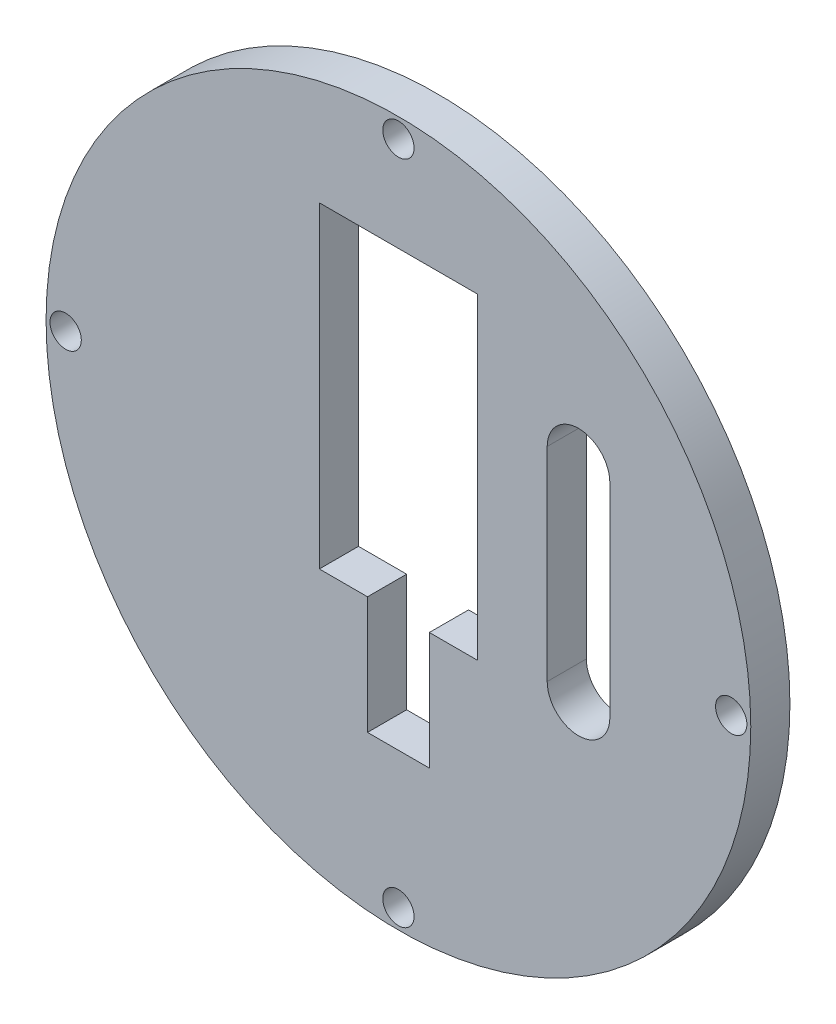
ISO-10303-21;
HEADER;
FILE_DESCRIPTION(('STEP AP214'),'2;1');
FILE_NAME('part.step','',(''),(''),'','','');
FILE_SCHEMA(('AUTOMOTIVE_DESIGN { 1 0 10303 214 1 1 1 1 }'));
ENDSEC;
DATA;
#1=APPLICATION_CONTEXT('core data for automotive mechanical design processes');
#2=APPLICATION_PROTOCOL_DEFINITION('international standard','automotive_design',2000,#1);
#3=PRODUCT_CONTEXT('',#1,'mechanical');
#4=PRODUCT('Part','Part','',(#3));
#5=PRODUCT_RELATED_PRODUCT_CATEGORY('part','',(#4));
#6=PRODUCT_DEFINITION_FORMATION('','',#4);
#7=PRODUCT_DEFINITION_CONTEXT('part definition',#1,'design');
#8=PRODUCT_DEFINITION('design','',#6,#7);
#9=PRODUCT_DEFINITION_SHAPE('','',#8);
#10=(LENGTH_UNIT() NAMED_UNIT(*) SI_UNIT(.MILLI.,.METRE.));
#11=(NAMED_UNIT(*) PLANE_ANGLE_UNIT() SI_UNIT($,.RADIAN.));
#12=(NAMED_UNIT(*) SI_UNIT($,.STERADIAN.) SOLID_ANGLE_UNIT());
#13=UNCERTAINTY_MEASURE_WITH_UNIT(LENGTH_MEASURE(1.E-05),#10,'distance_accuracy_value','');
#14=(GEOMETRIC_REPRESENTATION_CONTEXT(3) GLOBAL_UNCERTAINTY_ASSIGNED_CONTEXT((#13)) GLOBAL_UNIT_ASSIGNED_CONTEXT((#10,
#11,#12)) REPRESENTATION_CONTEXT('',''));
#15=CARTESIAN_POINT('',(0.,0.,0.));
#16=DIRECTION('',(0.,0.,1.));
#17=DIRECTION('',(1.,0.,0.));
#18=AXIS2_PLACEMENT_3D('',#15,#16,#17);
#19=CARTESIAN_POINT('',(0.,-10.1,5.));
#20=DIRECTION('',(0.,1.,0.));
#21=DIRECTION('',(0.,0.,1.));
#22=AXIS2_PLACEMENT_3D('',#19,#20,#21);
#23=PLANE('',#22);
#24=DIRECTION('',(0.,0.,-1.));
#25=VECTOR('',#24,1.);
#26=CARTESIAN_POINT('',(3.95,-10.1,10.));
#27=LINE('',#26,#25);
#28=CARTESIAN_POINT('',(3.95,-10.1,5.));
#29=VERTEX_POINT('',#28);
#30=CARTESIAN_POINT('',(3.95,-10.1,0.));
#31=VERTEX_POINT('',#30);
#32=EDGE_CURVE('E178',#29,#31,#27,.T.);
#33=ORIENTED_EDGE('',*,*,#32,.F.);
#34=DIRECTION('',(1.,0.,0.));
#35=VECTOR('',#34,1.);
#36=CARTESIAN_POINT('',(0.,-10.1,5.));
#37=LINE('',#36,#35);
#38=CARTESIAN_POINT('',(10.1,-10.1,5.));
#39=VERTEX_POINT('',#38);
#40=EDGE_CURVE('E213',#29,#39,#37,.T.);
#41=ORIENTED_EDGE('',*,*,#40,.T.);
#42=DIRECTION('',(0.,0.,-1.));
#43=VECTOR('',#42,1.);
#44=CARTESIAN_POINT('',(10.1,-10.1,5.));
#45=LINE('',#44,#43);
#46=CARTESIAN_POINT('',(10.1,-10.1,0.));
#47=VERTEX_POINT('',#46);
#48=EDGE_CURVE('E54',#39,#47,#45,.T.);
#49=ORIENTED_EDGE('',*,*,#48,.T.);
#50=DIRECTION('',(1.,0.,0.));
#51=VECTOR('',#50,1.);
#52=CARTESIAN_POINT('',(0.,-10.1,0.));
#53=LINE('',#52,#51);
#54=EDGE_CURVE('E241',#31,#47,#53,.T.);
#55=ORIENTED_EDGE('',*,*,#54,.F.);
#56=EDGE_LOOP('',(#33,#41,#49,#55));
#57=FACE_BOUND('',#56,.T.);
#58=ADVANCED_FACE('F46',(#57),#23,.T.);
#59=CARTESIAN_POINT('',(0.,30.4,5.));
#60=DIRECTION('',(0.,1.,0.));
#61=DIRECTION('',(0.,0.,1.));
#62=AXIS2_PLACEMENT_3D('',#59,#60,#61);
#63=PLANE('',#62);
#64=DIRECTION('',(1.,0.,0.));
#65=VECTOR('',#64,1.);
#66=CARTESIAN_POINT('',(0.,30.4,0.));
#67=LINE('',#66,#65);
#68=CARTESIAN_POINT('',(-10.1,30.4,0.));
#69=VERTEX_POINT('',#68);
#70=CARTESIAN_POINT('',(10.1,30.4,0.));
#71=VERTEX_POINT('',#70);
#72=EDGE_CURVE('E235',#69,#71,#67,.T.);
#73=ORIENTED_EDGE('',*,*,#72,.T.);
#74=DIRECTION('',(0.,0.,-1.));
#75=VECTOR('',#74,1.);
#76=CARTESIAN_POINT('',(10.1,30.4,5.));
#77=LINE('',#76,#75);
#78=CARTESIAN_POINT('',(10.1,30.4,5.));
#79=VERTEX_POINT('',#78);
#80=EDGE_CURVE('E13',#79,#71,#77,.T.);
#81=ORIENTED_EDGE('',*,*,#80,.F.);
#82=DIRECTION('',(1.,0.,0.));
#83=VECTOR('',#82,1.);
#84=CARTESIAN_POINT('',(0.,30.4,5.));
#85=LINE('',#84,#83);
#86=CARTESIAN_POINT('',(-10.1,30.4,5.));
#87=VERTEX_POINT('',#86);
#88=EDGE_CURVE('E207',#87,#79,#85,.T.);
#89=ORIENTED_EDGE('',*,*,#88,.F.);
#90=DIRECTION('',(0.,0.,-1.));
#91=VECTOR('',#90,1.);
#92=CARTESIAN_POINT('',(-10.1,30.4,5.));
#93=LINE('',#92,#91);
#94=EDGE_CURVE('E223',#87,#69,#93,.T.);
#95=ORIENTED_EDGE('',*,*,#94,.T.);
#96=EDGE_LOOP('',(#73,#81,#89,#95));
#97=FACE_BOUND('',#96,.T.);
#98=ADVANCED_FACE('F284',(#97),#63,.F.);
#99=CARTESIAN_POINT('',(10.1,0.,5.));
#100=DIRECTION('',(1.,0.,0.));
#101=DIRECTION('',(0.,1.,0.));
#102=AXIS2_PLACEMENT_3D('',#99,#100,#101);
#103=PLANE('',#102);
#104=DIRECTION('',(0.,-1.,0.));
#105=VECTOR('',#104,1.);
#106=CARTESIAN_POINT('',(10.1,0.,0.));
#107=LINE('',#106,#105);
#108=EDGE_CURVE('E238',#71,#47,#107,.T.);
#109=ORIENTED_EDGE('',*,*,#108,.T.);
#110=ORIENTED_EDGE('',*,*,#48,.F.);
#111=DIRECTION('',(0.,-1.,0.));
#112=VECTOR('',#111,1.);
#113=CARTESIAN_POINT('',(10.1,0.,5.));
#114=LINE('',#113,#112);
#115=EDGE_CURVE('E210',#79,#39,#114,.T.);
#116=ORIENTED_EDGE('',*,*,#115,.F.);
#117=ORIENTED_EDGE('',*,*,#80,.T.);
#118=EDGE_LOOP('',(#109,#110,#116,#117));
#119=FACE_BOUND('',#118,.T.);
#120=ADVANCED_FACE('F259',(#119),#103,.F.);
#121=DIRECTION('',(0.,0.,-1.));
#122=VECTOR('',#121,1.);
#123=CARTESIAN_POINT('',(-3.95,-10.1,10.));
#124=LINE('',#123,#122);
#125=CARTESIAN_POINT('',(-3.95,-10.1,5.));
#126=VERTEX_POINT('',#125);
#127=CARTESIAN_POINT('',(-3.95,-10.1,0.));
#128=VERTEX_POINT('',#127);
#129=EDGE_CURVE('E181',#126,#128,#124,.T.);
#130=ORIENTED_EDGE('',*,*,#129,.T.);
#131=CARTESIAN_POINT('',(-10.1,-10.1,0.));
#132=VERTEX_POINT('',#131);
#133=EDGE_CURVE('E242',#132,#128,#53,.T.);
#134=ORIENTED_EDGE('',*,*,#133,.F.);
#135=DIRECTION('',(0.,0.,-1.));
#136=VECTOR('',#135,1.);
#137=CARTESIAN_POINT('',(-10.1,-10.1,5.));
#138=LINE('',#137,#136);
#139=CARTESIAN_POINT('',(-10.1,-10.1,5.));
#140=VERTEX_POINT('',#139);
#141=EDGE_CURVE('E251',#140,#132,#138,.T.);
#142=ORIENTED_EDGE('',*,*,#141,.F.);
#143=EDGE_CURVE('E214',#140,#126,#37,.T.);
#144=ORIENTED_EDGE('',*,*,#143,.T.);
#145=EDGE_LOOP('',(#130,#134,#142,#144));
#146=FACE_BOUND('',#145,.T.);
#147=ADVANCED_FACE('F289',(#146),#23,.T.);
#148=CARTESIAN_POINT('',(-10.1,0.,5.));
#149=DIRECTION('',(1.,0.,0.));
#150=DIRECTION('',(0.,1.,0.));
#151=AXIS2_PLACEMENT_3D('',#148,#149,#150);
#152=PLANE('',#151);
#153=DIRECTION('',(0.,-1.,0.));
#154=VECTOR('',#153,1.);
#155=CARTESIAN_POINT('',(-10.1,0.,0.));
#156=LINE('',#155,#154);
#157=EDGE_CURVE('E245',#69,#132,#156,.T.);
#158=ORIENTED_EDGE('',*,*,#157,.F.);
#159=ORIENTED_EDGE('',*,*,#94,.F.);
#160=DIRECTION('',(0.,-1.,0.));
#161=VECTOR('',#160,1.);
#162=CARTESIAN_POINT('',(-10.1,0.,5.));
#163=LINE('',#162,#161);
#164=EDGE_CURVE('E217',#87,#140,#163,.T.);
#165=ORIENTED_EDGE('',*,*,#164,.T.);
#166=ORIENTED_EDGE('',*,*,#141,.T.);
#167=EDGE_LOOP('',(#158,#159,#165,#166));
#168=FACE_BOUND('',#167,.T.);
#169=ADVANCED_FACE('F286',(#168),#152,.T.);
#170=CARTESIAN_POINT('',(42.5,0.,5.));
#171=DIRECTION('',(0.,0.,-1.));
#172=DIRECTION('',(-1.,0.,0.));
#173=AXIS2_PLACEMENT_3D('',#170,#171,#172);
#174=CYLINDRICAL_SURFACE('',#173,2.);
#175=CARTESIAN_POINT('',(42.5,0.,5.));
#176=DIRECTION('',(0.,0.,1.));
#177=DIRECTION('',(1.,0.,0.));
#178=AXIS2_PLACEMENT_3D('',#175,#176,#177);
#179=CIRCLE('',#178,2.);
#180=CARTESIAN_POINT('',(44.5,0.,5.));
#181=VERTEX_POINT('',#180);
#182=EDGE_CURVE('E204',#181,#181,#179,.T.);
#183=ORIENTED_EDGE('',*,*,#182,.T.);
#184=EDGE_LOOP('',(#183));
#185=FACE_BOUND('',#184,.T.);
#186=CARTESIAN_POINT('',(42.5,0.,0.));
#187=DIRECTION('',(0.,0.,1.));
#188=DIRECTION('',(1.,0.,0.));
#189=AXIS2_PLACEMENT_3D('',#186,#187,#188);
#190=CIRCLE('',#189,2.);
#191=CARTESIAN_POINT('',(44.5,0.,0.));
#192=VERTEX_POINT('',#191);
#193=EDGE_CURVE('E232',#192,#192,#190,.T.);
#194=ORIENTED_EDGE('',*,*,#193,.F.);
#195=EDGE_LOOP('',(#194));
#196=FACE_BOUND('',#195,.T.);
#197=ADVANCED_FACE('F315',(#185,#196),#174,.F.);
#198=CARTESIAN_POINT('',(0.,-42.5,5.));
#199=DIRECTION('',(0.,0.,-1.));
#200=DIRECTION('',(-1.,0.,0.));
#201=AXIS2_PLACEMENT_3D('',#198,#199,#200);
#202=CYLINDRICAL_SURFACE('',#201,2.);
#203=CARTESIAN_POINT('',(0.,-42.5,5.));
#204=DIRECTION('',(0.,0.,1.));
#205=DIRECTION('',(1.,0.,0.));
#206=AXIS2_PLACEMENT_3D('',#203,#204,#205);
#207=CIRCLE('',#206,2.);
#208=CARTESIAN_POINT('',(2.00000000000001,-42.5,5.));
#209=VERTEX_POINT('',#208);
#210=EDGE_CURVE('E201',#209,#209,#207,.T.);
#211=ORIENTED_EDGE('',*,*,#210,.T.);
#212=EDGE_LOOP('',(#211));
#213=FACE_BOUND('',#212,.T.);
#214=CARTESIAN_POINT('',(0.,-42.5,0.));
#215=DIRECTION('',(0.,0.,1.));
#216=DIRECTION('',(1.,0.,0.));
#217=AXIS2_PLACEMENT_3D('',#214,#215,#216);
#218=CIRCLE('',#217,2.);
#219=CARTESIAN_POINT('',(2.00000000000001,-42.5,0.));
#220=VERTEX_POINT('',#219);
#221=EDGE_CURVE('E229',#220,#220,#218,.T.);
#222=ORIENTED_EDGE('',*,*,#221,.F.);
#223=EDGE_LOOP('',(#222));
#224=FACE_BOUND('',#223,.T.);
#225=ADVANCED_FACE('F321',(#213,#224),#202,.F.);
#226=CARTESIAN_POINT('',(-42.5,0.,5.));
#227=DIRECTION('',(0.,0.,-1.));
#228=DIRECTION('',(-1.,0.,0.));
#229=AXIS2_PLACEMENT_3D('',#226,#227,#228);
#230=CYLINDRICAL_SURFACE('',#229,2.);
#231=CARTESIAN_POINT('',(-42.5,0.,5.));
#232=DIRECTION('',(0.,0.,1.));
#233=DIRECTION('',(1.,0.,0.));
#234=AXIS2_PLACEMENT_3D('',#231,#232,#233);
#235=CIRCLE('',#234,2.);
#236=CARTESIAN_POINT('',(-40.5,0.,5.));
#237=VERTEX_POINT('',#236);
#238=EDGE_CURVE('E197',#237,#237,#235,.T.);
#239=ORIENTED_EDGE('',*,*,#238,.T.);
#240=EDGE_LOOP('',(#239));
#241=FACE_BOUND('',#240,.T.);
#242=CARTESIAN_POINT('',(-42.5,0.,0.));
#243=DIRECTION('',(0.,0.,1.));
#244=DIRECTION('',(1.,0.,0.));
#245=AXIS2_PLACEMENT_3D('',#242,#243,#244);
#246=CIRCLE('',#245,2.);
#247=CARTESIAN_POINT('',(-40.5,0.,0.));
#248=VERTEX_POINT('',#247);
#249=EDGE_CURVE('E226',#248,#248,#246,.T.);
#250=ORIENTED_EDGE('',*,*,#249,.F.);
#251=EDGE_LOOP('',(#250));
#252=FACE_BOUND('',#251,.T.);
#253=ADVANCED_FACE('F324',(#241,#252),#230,.F.);
#254=CARTESIAN_POINT('',(0.,42.5,5.));
#255=DIRECTION('',(0.,0.,-1.));
#256=DIRECTION('',(-1.,0.,0.));
#257=AXIS2_PLACEMENT_3D('',#254,#255,#256);
#258=CYLINDRICAL_SURFACE('',#257,2.);
#259=CARTESIAN_POINT('',(0.,42.5,5.));
#260=DIRECTION('',(0.,0.,1.));
#261=DIRECTION('',(1.,0.,0.));
#262=AXIS2_PLACEMENT_3D('',#259,#260,#261);
#263=CIRCLE('',#262,2.);
#264=CARTESIAN_POINT('',(1.99999999999997,42.5,5.));
#265=VERTEX_POINT('',#264);
#266=EDGE_CURVE('E194',#265,#265,#263,.T.);
#267=ORIENTED_EDGE('',*,*,#266,.T.);
#268=EDGE_LOOP('',(#267));
#269=FACE_BOUND('',#268,.T.);
#270=CARTESIAN_POINT('',(0.,42.5,0.));
#271=DIRECTION('',(0.,0.,1.));
#272=DIRECTION('',(1.,0.,0.));
#273=AXIS2_PLACEMENT_3D('',#270,#271,#272);
#274=CIRCLE('',#273,2.);
#275=CARTESIAN_POINT('',(1.99999999999997,42.5,0.));
#276=VERTEX_POINT('',#275);
#277=EDGE_CURVE('E193',#276,#276,#274,.T.);
#278=ORIENTED_EDGE('',*,*,#277,.F.);
#279=EDGE_LOOP('',(#278));
#280=FACE_BOUND('',#279,.T.);
#281=ADVANCED_FACE('F48',(#269,#280),#258,.F.);
#282=CARTESIAN_POINT('',(0.,0.,5.));
#283=DIRECTION('',(0.,0.,-1.));
#284=DIRECTION('',(-1.,0.,0.));
#285=AXIS2_PLACEMENT_3D('',#282,#283,#284);
#286=CYLINDRICAL_SURFACE('',#285,45.);
#287=CARTESIAN_POINT('',(0.,0.,5.));
#288=DIRECTION('',(0.,0.,1.));
#289=DIRECTION('',(1.,0.,0.));
#290=AXIS2_PLACEMENT_3D('',#287,#288,#289);
#291=CIRCLE('',#290,45.);
#292=CARTESIAN_POINT('',(45.,0.,5.));
#293=VERTEX_POINT('',#292);
#294=EDGE_CURVE('E220',#293,#293,#291,.T.);
#295=ORIENTED_EDGE('',*,*,#294,.F.);
#296=EDGE_LOOP('',(#295));
#297=FACE_BOUND('',#296,.T.);
#298=CARTESIAN_POINT('',(0.,0.,0.));
#299=DIRECTION('',(0.,0.,1.));
#300=DIRECTION('',(1.,0.,0.));
#301=AXIS2_PLACEMENT_3D('',#298,#299,#300);
#302=CIRCLE('',#301,45.);
#303=CARTESIAN_POINT('',(45.,0.,0.));
#304=VERTEX_POINT('',#303);
#305=EDGE_CURVE('E198',#304,#304,#302,.T.);
#306=ORIENTED_EDGE('',*,*,#305,.T.);
#307=EDGE_LOOP('',(#306));
#308=FACE_BOUND('',#307,.T.);
#309=ADVANCED_FACE('F331',(#297,#308),#286,.T.);
#310=CARTESIAN_POINT('',(0.,0.,5.));
#311=DIRECTION('',(0.,0.,1.));
#312=DIRECTION('',(1.,0.,0.));
#313=AXIS2_PLACEMENT_3D('',#310,#311,#312);
#314=PLANE('',#313);
#315=CARTESIAN_POINT('',(23.,18.,5.));
#316=DIRECTION('',(0.,0.,1.));
#317=DIRECTION('',(1.,0.,0.));
#318=AXIS2_PLACEMENT_3D('',#315,#316,#317);
#319=CIRCLE('',#318,4.);
#320=CARTESIAN_POINT('',(27.,18.,5.));
#321=VERTEX_POINT('',#320);
#322=CARTESIAN_POINT('',(19.,18.,5.));
#323=VERTEX_POINT('',#322);
#324=EDGE_CURVE('E168',#321,#323,#319,.T.);
#325=ORIENTED_EDGE('',*,*,#324,.F.);
#326=DIRECTION('',(0.,1.,0.));
#327=VECTOR('',#326,1.);
#328=CARTESIAN_POINT('',(27.,0.,5.));
#329=LINE('',#328,#327);
#330=CARTESIAN_POINT('',(27.,-8.,5.));
#331=VERTEX_POINT('',#330);
#332=EDGE_CURVE('E161',#331,#321,#329,.T.);
#333=ORIENTED_EDGE('',*,*,#332,.F.);
#334=CARTESIAN_POINT('',(23.,-8.,5.));
#335=DIRECTION('',(0.,0.,1.));
#336=DIRECTION('',(1.,0.,0.));
#337=AXIS2_PLACEMENT_3D('',#334,#335,#336);
#338=CIRCLE('',#337,4.);
#339=CARTESIAN_POINT('',(19.,-8.,5.));
#340=VERTEX_POINT('',#339);
#341=EDGE_CURVE('E141',#340,#331,#338,.T.);
#342=ORIENTED_EDGE('',*,*,#341,.F.);
#343=DIRECTION('',(0.,-1.,0.));
#344=VECTOR('',#343,1.);
#345=CARTESIAN_POINT('',(19.,0.,5.));
#346=LINE('',#345,#344);
#347=EDGE_CURVE('E166',#323,#340,#346,.T.);
#348=ORIENTED_EDGE('',*,*,#347,.F.);
#349=EDGE_LOOP('',(#325,#333,#342,#348));
#350=FACE_BOUND('',#349,.T.);
#351=DIRECTION('',(0.,1.,0.));
#352=VECTOR('',#351,1.);
#353=CARTESIAN_POINT('',(3.95,0.,5.));
#354=LINE('',#353,#352);
#355=CARTESIAN_POINT('',(3.95,-25.1,5.));
#356=VERTEX_POINT('',#355);
#357=EDGE_CURVE('E191',#356,#29,#354,.T.);
#358=ORIENTED_EDGE('',*,*,#357,.F.);
#359=DIRECTION('',(1.,0.,0.));
#360=VECTOR('',#359,1.);
#361=CARTESIAN_POINT('',(0.,-25.1,5.));
#362=LINE('',#361,#360);
#363=CARTESIAN_POINT('',(-3.95,-25.1,5.));
#364=VERTEX_POINT('',#363);
#365=EDGE_CURVE('E180',#364,#356,#362,.T.);
#366=ORIENTED_EDGE('',*,*,#365,.F.);
#367=DIRECTION('',(0.,-1.,0.));
#368=VECTOR('',#367,1.);
#369=CARTESIAN_POINT('',(-3.95,0.,5.));
#370=LINE('',#369,#368);
#371=EDGE_CURVE('E189',#126,#364,#370,.T.);
#372=ORIENTED_EDGE('',*,*,#371,.F.);
#373=ORIENTED_EDGE('',*,*,#143,.F.);
#374=ORIENTED_EDGE('',*,*,#164,.F.);
#375=ORIENTED_EDGE('',*,*,#88,.T.);
#376=ORIENTED_EDGE('',*,*,#115,.T.);
#377=ORIENTED_EDGE('',*,*,#40,.F.);
#378=EDGE_LOOP('',(#358,#366,#372,#373,#374,#375,#376,#377));
#379=FACE_BOUND('',#378,.T.);
#380=ORIENTED_EDGE('',*,*,#266,.F.);
#381=EDGE_LOOP('',(#380));
#382=FACE_BOUND('',#381,.T.);
#383=ORIENTED_EDGE('',*,*,#238,.F.);
#384=EDGE_LOOP('',(#383));
#385=FACE_BOUND('',#384,.T.);
#386=ORIENTED_EDGE('',*,*,#210,.F.);
#387=EDGE_LOOP('',(#386));
#388=FACE_BOUND('',#387,.T.);
#389=ORIENTED_EDGE('',*,*,#182,.F.);
#390=EDGE_LOOP('',(#389));
#391=FACE_BOUND('',#390,.T.);
#392=ORIENTED_EDGE('',*,*,#294,.T.);
#393=EDGE_LOOP('',(#392));
#394=FACE_BOUND('',#393,.T.);
#395=ADVANCED_FACE('F278',(#350,#379,#382,#385,#388,#391,#394),#314,.T.);
#396=CARTESIAN_POINT('',(0.,0.,0.));
#397=DIRECTION('',(0.,0.,1.));
#398=DIRECTION('',(1.,0.,0.));
#399=AXIS2_PLACEMENT_3D('',#396,#397,#398);
#400=PLANE('',#399);
#401=DIRECTION('',(0.,-1.,0.));
#402=VECTOR('',#401,1.);
#403=CARTESIAN_POINT('',(27.,18.,0.));
#404=LINE('',#403,#402);
#405=CARTESIAN_POINT('',(27.,18.,0.));
#406=VERTEX_POINT('',#405);
#407=CARTESIAN_POINT('',(27.,-8.,0.));
#408=VERTEX_POINT('',#407);
#409=EDGE_CURVE('E147',#406,#408,#404,.T.);
#410=ORIENTED_EDGE('',*,*,#409,.F.);
#411=CARTESIAN_POINT('',(23.,18.,0.));
#412=DIRECTION('',(0.,0.,-1.));
#413=DIRECTION('',(-1.,0.,0.));
#414=AXIS2_PLACEMENT_3D('',#411,#412,#413);
#415=CIRCLE('',#414,4.);
#416=CARTESIAN_POINT('',(19.,18.,0.));
#417=VERTEX_POINT('',#416);
#418=EDGE_CURVE('E69',#417,#406,#415,.T.);
#419=ORIENTED_EDGE('',*,*,#418,.F.);
#420=DIRECTION('',(0.,1.,0.));
#421=VECTOR('',#420,1.);
#422=CARTESIAN_POINT('',(19.,18.,0.));
#423=LINE('',#422,#421);
#424=CARTESIAN_POINT('',(19.,-8.,0.));
#425=VERTEX_POINT('',#424);
#426=EDGE_CURVE('E154',#425,#417,#423,.T.);
#427=ORIENTED_EDGE('',*,*,#426,.F.);
#428=CARTESIAN_POINT('',(23.,-8.,0.));
#429=DIRECTION('',(0.,0.,-1.));
#430=DIRECTION('',(-1.,0.,0.));
#431=AXIS2_PLACEMENT_3D('',#428,#429,#430);
#432=CIRCLE('',#431,4.);
#433=EDGE_CURVE('E138',#408,#425,#432,.T.);
#434=ORIENTED_EDGE('',*,*,#433,.F.);
#435=EDGE_LOOP('',(#410,#419,#427,#434));
#436=FACE_BOUND('',#435,.T.);
#437=ORIENTED_EDGE('',*,*,#277,.T.);
#438=EDGE_LOOP('',(#437));
#439=FACE_BOUND('',#438,.T.);
#440=ORIENTED_EDGE('',*,*,#249,.T.);
#441=EDGE_LOOP('',(#440));
#442=FACE_BOUND('',#441,.T.);
#443=ORIENTED_EDGE('',*,*,#221,.T.);
#444=EDGE_LOOP('',(#443));
#445=FACE_BOUND('',#444,.T.);
#446=ORIENTED_EDGE('',*,*,#193,.T.);
#447=EDGE_LOOP('',(#446));
#448=FACE_BOUND('',#447,.T.);
#449=DIRECTION('',(-1.,0.,0.));
#450=VECTOR('',#449,1.);
#451=CARTESIAN_POINT('',(3.95,-25.1,0.));
#452=LINE('',#451,#450);
#453=CARTESIAN_POINT('',(3.95,-25.1,0.));
#454=VERTEX_POINT('',#453);
#455=CARTESIAN_POINT('',(-3.95,-25.1,0.));
#456=VERTEX_POINT('',#455);
#457=EDGE_CURVE('E172',#454,#456,#452,.T.);
#458=ORIENTED_EDGE('',*,*,#457,.F.);
#459=DIRECTION('',(0.,-1.,0.));
#460=VECTOR('',#459,1.);
#461=CARTESIAN_POINT('',(3.95,-10.1,0.));
#462=LINE('',#461,#460);
#463=EDGE_CURVE('E170',#31,#454,#462,.T.);
#464=ORIENTED_EDGE('',*,*,#463,.F.);
#465=ORIENTED_EDGE('',*,*,#54,.T.);
#466=ORIENTED_EDGE('',*,*,#108,.F.);
#467=ORIENTED_EDGE('',*,*,#72,.F.);
#468=ORIENTED_EDGE('',*,*,#157,.T.);
#469=ORIENTED_EDGE('',*,*,#133,.T.);
#470=DIRECTION('',(0.,1.,0.));
#471=VECTOR('',#470,1.);
#472=CARTESIAN_POINT('',(-3.95,-10.1,0.));
#473=LINE('',#472,#471);
#474=EDGE_CURVE('E175',#456,#128,#473,.T.);
#475=ORIENTED_EDGE('',*,*,#474,.F.);
#476=EDGE_LOOP('',(#458,#464,#465,#466,#467,#468,#469,#475));
#477=FACE_BOUND('',#476,.T.);
#478=ORIENTED_EDGE('',*,*,#305,.F.);
#479=EDGE_LOOP('',(#478));
#480=FACE_BOUND('',#479,.T.);
#481=ADVANCED_FACE('F151',(#436,#439,#442,#445,#448,#477,#480),#400,.F.);
#482=CARTESIAN_POINT('',(3.95,-10.1,10.));
#483=DIRECTION('',(1.,0.,0.));
#484=DIRECTION('',(0.,1.,0.));
#485=AXIS2_PLACEMENT_3D('',#482,#483,#484);
#486=PLANE('',#485);
#487=ORIENTED_EDGE('',*,*,#357,.T.);
#488=ORIENTED_EDGE('',*,*,#32,.T.);
#489=ORIENTED_EDGE('',*,*,#463,.T.);
#490=DIRECTION('',(0.,0.,-1.));
#491=VECTOR('',#490,1.);
#492=CARTESIAN_POINT('',(3.95,-25.1,10.));
#493=LINE('',#492,#491);
#494=EDGE_CURVE('E177',#356,#454,#493,.T.);
#495=ORIENTED_EDGE('',*,*,#494,.F.);
#496=EDGE_LOOP('',(#487,#488,#489,#495));
#497=FACE_BOUND('',#496,.T.);
#498=ADVANCED_FACE('F270',(#497),#486,.F.);
#499=CARTESIAN_POINT('',(-3.95,-10.1,10.));
#500=DIRECTION('',(-1.,0.,0.));
#501=DIRECTION('',(0.,-1.,0.));
#502=AXIS2_PLACEMENT_3D('',#499,#500,#501);
#503=PLANE('',#502);
#504=ORIENTED_EDGE('',*,*,#371,.T.);
#505=DIRECTION('',(0.,0.,-1.));
#506=VECTOR('',#505,1.);
#507=CARTESIAN_POINT('',(-3.95,-25.1,10.));
#508=LINE('',#507,#506);
#509=EDGE_CURVE('E184',#364,#456,#508,.T.);
#510=ORIENTED_EDGE('',*,*,#509,.T.);
#511=ORIENTED_EDGE('',*,*,#474,.T.);
#512=ORIENTED_EDGE('',*,*,#129,.F.);
#513=EDGE_LOOP('',(#504,#510,#511,#512));
#514=FACE_BOUND('',#513,.T.);
#515=ADVANCED_FACE('F291',(#514),#503,.F.);
#516=CARTESIAN_POINT('',(3.95,-25.1,10.));
#517=DIRECTION('',(0.,-1.,0.));
#518=DIRECTION('',(0.,0.,-1.));
#519=AXIS2_PLACEMENT_3D('',#516,#517,#518);
#520=PLANE('',#519);
#521=ORIENTED_EDGE('',*,*,#365,.T.);
#522=ORIENTED_EDGE('',*,*,#494,.T.);
#523=ORIENTED_EDGE('',*,*,#457,.T.);
#524=ORIENTED_EDGE('',*,*,#509,.F.);
#525=EDGE_LOOP('',(#521,#522,#523,#524));
#526=FACE_BOUND('',#525,.T.);
#527=ADVANCED_FACE('F273',(#526),#520,.F.);
#528=CARTESIAN_POINT('',(23.,18.,10.));
#529=DIRECTION('',(0.,0.,-1.));
#530=DIRECTION('',(-1.,0.,0.));
#531=AXIS2_PLACEMENT_3D('',#528,#529,#530);
#532=CYLINDRICAL_SURFACE('',#531,4.);
#533=ORIENTED_EDGE('',*,*,#324,.T.);
#534=DIRECTION('',(0.,0.,-1.));
#535=VECTOR('',#534,1.);
#536=CARTESIAN_POINT('',(19.,18.,10.));
#537=LINE('',#536,#535);
#538=EDGE_CURVE('E159',#323,#417,#537,.T.);
#539=ORIENTED_EDGE('',*,*,#538,.T.);
#540=ORIENTED_EDGE('',*,*,#418,.T.);
#541=DIRECTION('',(0.,0.,-1.));
#542=VECTOR('',#541,1.);
#543=CARTESIAN_POINT('',(27.,18.,10.));
#544=LINE('',#543,#542);
#545=EDGE_CURVE('E144',#321,#406,#544,.T.);
#546=ORIENTED_EDGE('',*,*,#545,.F.);
#547=EDGE_LOOP('',(#533,#539,#540,#546));
#548=FACE_BOUND('',#547,.T.);
#549=ADVANCED_FACE('F298',(#548),#532,.F.);
#550=CARTESIAN_POINT('',(19.,18.,10.));
#551=DIRECTION('',(-1.,0.,0.));
#552=DIRECTION('',(0.,0.,1.));
#553=AXIS2_PLACEMENT_3D('',#550,#551,#552);
#554=PLANE('',#553);
#555=ORIENTED_EDGE('',*,*,#347,.T.);
#556=DIRECTION('',(0.,0.,-1.));
#557=VECTOR('',#556,1.);
#558=CARTESIAN_POINT('',(19.,-8.,10.));
#559=LINE('',#558,#557);
#560=EDGE_CURVE('E143',#340,#425,#559,.T.);
#561=ORIENTED_EDGE('',*,*,#560,.T.);
#562=ORIENTED_EDGE('',*,*,#426,.T.);
#563=ORIENTED_EDGE('',*,*,#538,.F.);
#564=EDGE_LOOP('',(#555,#561,#562,#563));
#565=FACE_BOUND('',#564,.T.);
#566=ADVANCED_FACE('F397',(#565),#554,.F.);
#567=CARTESIAN_POINT('',(23.,-8.,10.));
#568=DIRECTION('',(0.,0.,-1.));
#569=DIRECTION('',(-1.,0.,0.));
#570=AXIS2_PLACEMENT_3D('',#567,#568,#569);
#571=CYLINDRICAL_SURFACE('',#570,4.);
#572=ORIENTED_EDGE('',*,*,#341,.T.);
#573=DIRECTION('',(0.,0.,-1.));
#574=VECTOR('',#573,1.);
#575=CARTESIAN_POINT('',(27.,-8.,10.));
#576=LINE('',#575,#574);
#577=EDGE_CURVE('E61',#331,#408,#576,.T.);
#578=ORIENTED_EDGE('',*,*,#577,.T.);
#579=ORIENTED_EDGE('',*,*,#433,.T.);
#580=ORIENTED_EDGE('',*,*,#560,.F.);
#581=EDGE_LOOP('',(#572,#578,#579,#580));
#582=FACE_BOUND('',#581,.T.);
#583=ADVANCED_FACE('F135',(#582),#571,.F.);
#584=CARTESIAN_POINT('',(27.,18.,10.));
#585=DIRECTION('',(1.,0.,0.));
#586=DIRECTION('',(0.,0.,-1.));
#587=AXIS2_PLACEMENT_3D('',#584,#585,#586);
#588=PLANE('',#587);
#589=ORIENTED_EDGE('',*,*,#332,.T.);
#590=ORIENTED_EDGE('',*,*,#545,.T.);
#591=ORIENTED_EDGE('',*,*,#409,.T.);
#592=ORIENTED_EDGE('',*,*,#577,.F.);
#593=EDGE_LOOP('',(#589,#590,#591,#592));
#594=FACE_BOUND('',#593,.T.);
#595=ADVANCED_FACE('F148',(#594),#588,.F.);
#596=CLOSED_SHELL('',(#58,#98,#120,#147,#169,#197,#225,#253,#281,#309,#395,#481,#498,#515,#527,
#549,#566,#583,#595));
#597=MANIFOLD_SOLID_BREP('B2',#596);
#598=ADVANCED_BREP_SHAPE_REPRESENTATION('',(#18,#597),#14);
#599=SHAPE_DEFINITION_REPRESENTATION(#9,#598);
ENDSEC;
END-ISO-10303-21;
